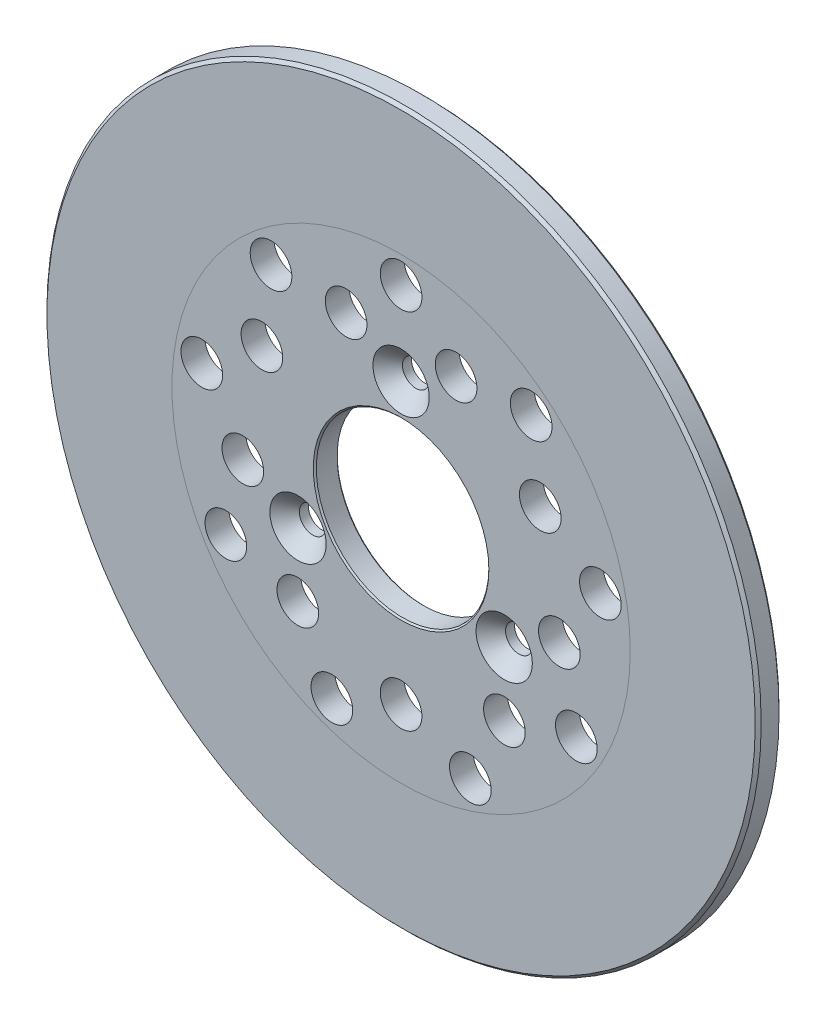
ISO-10303-21;
HEADER;
FILE_DESCRIPTION(('STEP AP214'),'2;1');
FILE_NAME('part.step','',(''),(''),'','','');
FILE_SCHEMA(('AUTOMOTIVE_DESIGN { 1 0 10303 214 1 1 1 1 }'));
ENDSEC;
DATA;
#1=APPLICATION_CONTEXT('core data for automotive mechanical design processes');
#2=APPLICATION_PROTOCOL_DEFINITION('international standard','automotive_design',2000,#1);
#3=PRODUCT_CONTEXT('',#1,'mechanical');
#4=PRODUCT('Part','Part','',(#3));
#5=PRODUCT_RELATED_PRODUCT_CATEGORY('part','',(#4));
#6=PRODUCT_DEFINITION_FORMATION('','',#4);
#7=PRODUCT_DEFINITION_CONTEXT('part definition',#1,'design');
#8=PRODUCT_DEFINITION('design','',#6,#7);
#9=PRODUCT_DEFINITION_SHAPE('','',#8);
#10=(LENGTH_UNIT() NAMED_UNIT(*) SI_UNIT(.MILLI.,.METRE.));
#11=(NAMED_UNIT(*) PLANE_ANGLE_UNIT() SI_UNIT($,.RADIAN.));
#12=(NAMED_UNIT(*) SI_UNIT($,.STERADIAN.) SOLID_ANGLE_UNIT());
#13=UNCERTAINTY_MEASURE_WITH_UNIT(LENGTH_MEASURE(1.E-05),#10,'distance_accuracy_value','');
#14=(GEOMETRIC_REPRESENTATION_CONTEXT(3) GLOBAL_UNCERTAINTY_ASSIGNED_CONTEXT((#13)) GLOBAL_UNIT_ASSIGNED_CONTEXT((#10,
#11,#12)) REPRESENTATION_CONTEXT('',''));
#15=CARTESIAN_POINT('',(0.,0.,0.));
#16=DIRECTION('',(0.,0.,1.));
#17=DIRECTION('',(1.,0.,0.));
#18=AXIS2_PLACEMENT_3D('',#15,#16,#17);
#19=CARTESIAN_POINT('',(0.,0.,0.));
#20=DIRECTION('',(0.,0.,1.));
#21=DIRECTION('',(1.,0.,0.));
#22=AXIS2_PLACEMENT_3D('',#19,#20,#21);
#23=PLANE('',#22);
#24=CARTESIAN_POINT('',(0.,0.,0.));
#25=DIRECTION('',(0.,0.,1.));
#26=DIRECTION('',(1.,0.,0.));
#27=AXIS2_PLACEMENT_3D('',#24,#25,#26);
#28=CIRCLE('',#27,119.);
#29=CARTESIAN_POINT('',(119.,0.,0.));
#30=VERTEX_POINT('',#29);
#31=EDGE_CURVE('E45',#30,#30,#28,.F.);
#32=ORIENTED_EDGE('',*,*,#31,.T.);
#33=EDGE_LOOP('',(#32));
#34=FACE_BOUND('',#33,.T.);
#35=CARTESIAN_POINT('',(0.,0.,0.));
#36=DIRECTION('',(0.,0.,1.));
#37=DIRECTION('',(1.,0.,0.));
#38=AXIS2_PLACEMENT_3D('',#35,#36,#37);
#39=CIRCLE('',#38,77.);
#40=CARTESIAN_POINT('',(77.,0.,0.));
#41=VERTEX_POINT('',#40);
#42=EDGE_CURVE('E58',#41,#41,#39,.F.);
#43=ORIENTED_EDGE('',*,*,#42,.F.);
#44=EDGE_LOOP('',(#43));
#45=FACE_BOUND('',#44,.T.);
#46=ADVANCED_FACE('F38',(#34,#45),#23,.F.);
#47=CARTESIAN_POINT('',(0.,0.,8.));
#48=DIRECTION('',(0.,0.,1.));
#49=DIRECTION('',(1.,0.,0.));
#50=AXIS2_PLACEMENT_3D('',#47,#48,#49);
#51=PLANE('',#50);
#52=CARTESIAN_POINT('',(0.,0.,8.));
#53=DIRECTION('',(0.,0.,1.));
#54=DIRECTION('',(1.,0.,0.));
#55=AXIS2_PLACEMENT_3D('',#52,#53,#54);
#56=CIRCLE('',#55,119.);
#57=CARTESIAN_POINT('',(119.,0.,8.));
#58=VERTEX_POINT('',#57);
#59=EDGE_CURVE('E10',#58,#58,#56,.T.);
#60=ORIENTED_EDGE('',*,*,#59,.T.);
#61=EDGE_LOOP('',(#60));
#62=FACE_BOUND('',#61,.T.);
#63=CARTESIAN_POINT('',(0.,0.,8.));
#64=DIRECTION('',(0.,0.,1.));
#65=DIRECTION('',(1.,0.,0.));
#66=AXIS2_PLACEMENT_3D('',#63,#64,#65);
#67=CIRCLE('',#66,77.);
#68=CARTESIAN_POINT('',(77.,0.,8.));
#69=VERTEX_POINT('',#68);
#70=EDGE_CURVE('E59',#69,#69,#67,.F.);
#71=ORIENTED_EDGE('',*,*,#70,.T.);
#72=EDGE_LOOP('',(#71));
#73=FACE_BOUND('',#72,.T.);
#74=ADVANCED_FACE('F227',(#62,#73),#51,.T.);
#75=CARTESIAN_POINT('',(-43.7095574586841,52.0910221320911,8.));
#76=DIRECTION('',(0.,0.,1.));
#77=DIRECTION('',(0.766044443118986,0.64278760968653,0.));
#78=AXIS2_PLACEMENT_3D('',#75,#76,#77);
#79=CIRCLE('',#78,7.);
#80=CARTESIAN_POINT('',(-38.3472463568511,56.5905353998968,8.));
#81=VERTEX_POINT('',#80);
#82=EDGE_CURVE('E208',#81,#81,#79,.T.);
#83=ORIENTED_EDGE('',*,*,#82,.F.);
#84=EDGE_LOOP('',(#83));
#85=FACE_BOUND('',#84,.T.);
#86=CARTESIAN_POINT('',(-66.96692720483,11.808076081352,8.));
#87=DIRECTION('',(0.,0.,1.));
#88=DIRECTION('',(0.17364817766694,0.984807753012206,0.));
#89=AXIS2_PLACEMENT_3D('',#86,#87,#88);
#90=CIRCLE('',#89,7.);
#91=CARTESIAN_POINT('',(-65.7513899611614,18.7017303524374,8.));
#92=VERTEX_POINT('',#91);
#93=EDGE_CURVE('E202',#92,#92,#90,.T.);
#94=ORIENTED_EDGE('',*,*,#93,.F.);
#95=EDGE_LOOP('',(#94));
#96=FACE_BOUND('',#95,.T.);
#97=CARTESIAN_POINT('',(-58.8897274573421,-33.9999999999995,8.));
#98=DIRECTION('',(0.,0.,1.));
#99=DIRECTION('',(-0.499999999999992,0.866025403784443,0.));
#100=AXIS2_PLACEMENT_3D('',#97,#98,#99);
#101=CIRCLE('',#100,7.);
#102=CARTESIAN_POINT('',(-62.3897274573421,-27.9378221735084,8.));
#103=VERTEX_POINT('',#102);
#104=EDGE_CURVE('E196',#103,#103,#101,.T.);
#105=ORIENTED_EDGE('',*,*,#104,.F.);
#106=EDGE_LOOP('',(#105));
#107=FACE_BOUND('',#106,.T.);
#108=CARTESIAN_POINT('',(-23.257369746146,-63.8990982134416,8.));
#109=DIRECTION('',(0.,0.,1.));
#110=DIRECTION('',(-0.939692620785906,0.342020143325676,0.));
#111=AXIS2_PLACEMENT_3D('',#108,#109,#110);
#112=CIRCLE('',#111,7.);
#113=CARTESIAN_POINT('',(-29.8352180916473,-61.5049572101619,8.));
#114=VERTEX_POINT('',#113);
#115=EDGE_CURVE('E190',#114,#114,#112,.T.);
#116=ORIENTED_EDGE('',*,*,#115,.F.);
#117=EDGE_LOOP('',(#116));
#118=FACE_BOUND('',#117,.T.);
#119=CARTESIAN_POINT('',(23.2573697461451,-63.8990982134419,8.));
#120=DIRECTION('',(0.,0.,1.));
#121=DIRECTION('',(-0.939692620785911,-0.342020143325663,0.));
#122=AXIS2_PLACEMENT_3D('',#119,#120,#121);
#123=CIRCLE('',#122,7.);
#124=CARTESIAN_POINT('',(16.6795214006437,-66.2932392167216,8.));
#125=VERTEX_POINT('',#124);
#126=EDGE_CURVE('E184',#125,#125,#123,.T.);
#127=ORIENTED_EDGE('',*,*,#126,.F.);
#128=EDGE_LOOP('',(#127));
#129=FACE_BOUND('',#128,.T.);
#130=CARTESIAN_POINT('',(58.8897274573417,-34.0000000000003,8.));
#131=DIRECTION('',(0.,0.,1.));
#132=DIRECTION('',(-0.500000000000004,-0.866025403784436,0.));
#133=AXIS2_PLACEMENT_3D('',#130,#131,#132);
#134=CIRCLE('',#133,7.);
#135=CARTESIAN_POINT('',(55.3897274573417,-40.0621778264913,8.));
#136=VERTEX_POINT('',#135);
#137=EDGE_CURVE('E178',#136,#136,#134,.T.);
#138=ORIENTED_EDGE('',*,*,#137,.F.);
#139=EDGE_LOOP('',(#138));
#140=FACE_BOUND('',#139,.T.);
#141=CARTESIAN_POINT('',(66.9669272048302,11.8080760813511,8.));
#142=DIRECTION('',(0.,0.,1.));
#143=DIRECTION('',(0.173648177666927,-0.984807753012209,0.));
#144=AXIS2_PLACEMENT_3D('',#141,#142,#143);
#145=CIRCLE('',#144,7.);
#146=CARTESIAN_POINT('',(68.1824644484987,4.9144218102656,8.));
#147=VERTEX_POINT('',#146);
#148=EDGE_CURVE('E172',#147,#147,#145,.T.);
#149=ORIENTED_EDGE('',*,*,#148,.F.);
#150=EDGE_LOOP('',(#149));
#151=FACE_BOUND('',#150,.T.);
#152=CARTESIAN_POINT('',(43.7095574586848,52.0910221320905,8.));
#153=DIRECTION('',(0.,0.,1.));
#154=DIRECTION('',(0.766044443118977,-0.642787609686541,0.));
#155=AXIS2_PLACEMENT_3D('',#152,#153,#154);
#156=CIRCLE('',#155,7.);
#157=CARTESIAN_POINT('',(49.0718685605176,47.5915088642847,8.));
#158=VERTEX_POINT('',#157);
#159=EDGE_CURVE('E166',#158,#158,#156,.T.);
#160=ORIENTED_EDGE('',*,*,#159,.F.);
#161=EDGE_LOOP('',(#160));
#162=FACE_BOUND('',#161,.T.);
#163=CARTESIAN_POINT('',(0.,68.,8.));
#164=DIRECTION('',(0.,0.,1.));
#165=DIRECTION('',(1.,0.,0.));
#166=AXIS2_PLACEMENT_3D('',#163,#164,#165);
#167=CIRCLE('',#166,7.);
#168=CARTESIAN_POINT('',(7.,68.,8.));
#169=VERTEX_POINT('',#168);
#170=EDGE_CURVE('E160',#169,#169,#167,.T.);
#171=ORIENTED_EDGE('',*,*,#170,.F.);
#172=EDGE_LOOP('',(#171));
#173=FACE_BOUND('',#172,.T.);
#174=ORIENTED_EDGE('',*,*,#70,.F.);
#175=EDGE_LOOP('',(#174));
#176=FACE_BOUND('',#175,.T.);
#177=CARTESIAN_POINT('',(-18.4690877395855,50.7434015224393,8.));
#178=DIRECTION('',(0.,0.,1.));
#179=DIRECTION('',(0.766044443118986,0.64278760968653,0.));
#180=AXIS2_PLACEMENT_3D('',#177,#178,#179);
#181=CIRCLE('',#180,7.);
#182=CARTESIAN_POINT('',(-13.1067766377526,55.242914790245,8.));
#183=VERTEX_POINT('',#182);
#184=EDGE_CURVE('E154',#183,#183,#181,.T.);
#185=ORIENTED_EDGE('',*,*,#184,.F.);
#186=EDGE_LOOP('',(#185));
#187=FACE_BOUND('',#186,.T.);
#188=CARTESIAN_POINT('',(-46.7653718043594,27.0000000000005,8.));
#189=DIRECTION('',(0.,0.,1.));
#190=DIRECTION('',(0.17364817766694,0.984807753012206,0.));
#191=AXIS2_PLACEMENT_3D('',#188,#189,#190);
#192=CIRCLE('',#191,7.);
#193=CARTESIAN_POINT('',(-45.5498345606908,33.893654271086,8.));
#194=VERTEX_POINT('',#193);
#195=EDGE_CURVE('E148',#194,#194,#192,.T.);
#196=ORIENTED_EDGE('',*,*,#195,.F.);
#197=EDGE_LOOP('',(#196));
#198=FACE_BOUND('',#197,.T.);
#199=CARTESIAN_POINT('',(-53.1796186626593,-9.37700159401371,8.));
#200=DIRECTION('',(0.,0.,1.));
#201=DIRECTION('',(-0.499999999999992,0.866025403784443,0.));
#202=AXIS2_PLACEMENT_3D('',#199,#200,#201);
#203=CIRCLE('',#202,7.);
#204=CARTESIAN_POINT('',(-56.6796186626593,-3.3148237675226,8.));
#205=VERTEX_POINT('',#204);
#206=EDGE_CURVE('E142',#205,#205,#203,.T.);
#207=ORIENTED_EDGE('',*,*,#206,.F.);
#208=EDGE_LOOP('',(#207));
#209=FACE_BOUND('',#208,.T.);
#210=CARTESIAN_POINT('',(-34.7105309230735,-41.3663999284245,8.));
#211=DIRECTION('',(0.,0.,1.));
#212=DIRECTION('',(-0.939692620785906,0.342020143325676,0.));
#213=AXIS2_PLACEMENT_3D('',#210,#211,#212);
#214=CIRCLE('',#213,7.);
#215=CARTESIAN_POINT('',(-41.2883792685748,-38.9722589251448,8.));
#216=VERTEX_POINT('',#215);
#217=EDGE_CURVE('E136',#216,#216,#214,.T.);
#218=ORIENTED_EDGE('',*,*,#217,.F.);
#219=EDGE_LOOP('',(#218));
#220=FACE_BOUND('',#219,.T.);
#221=CARTESIAN_POINT('',(-3.67761376907083E-13,-54.,8.));
#222=DIRECTION('',(0.,0.,1.));
#223=DIRECTION('',(-0.939692620785911,-0.342020143325663,0.));
#224=AXIS2_PLACEMENT_3D('',#221,#222,#223);
#225=CIRCLE('',#224,7.);
#226=CARTESIAN_POINT('',(-6.57784834550174,-56.3941410032796,8.));
#227=VERTEX_POINT('',#226);
#228=EDGE_CURVE('E130',#227,#227,#225,.T.);
#229=ORIENTED_EDGE('',*,*,#228,.F.);
#230=EDGE_LOOP('',(#229));
#231=FACE_BOUND('',#230,.T.);
#232=CARTESIAN_POINT('',(34.7105309230729,-41.366399928425,8.));
#233=DIRECTION('',(0.,0.,1.));
#234=DIRECTION('',(-0.500000000000004,-0.866025403784436,0.));
#235=AXIS2_PLACEMENT_3D('',#232,#233,#234);
#236=CIRCLE('',#235,7.);
#237=CARTESIAN_POINT('',(31.2105309230729,-47.4285777549161,8.));
#238=VERTEX_POINT('',#237);
#239=EDGE_CURVE('E124',#238,#238,#236,.T.);
#240=ORIENTED_EDGE('',*,*,#239,.F.);
#241=EDGE_LOOP('',(#240));
#242=FACE_BOUND('',#241,.T.);
#243=CARTESIAN_POINT('',(53.1796186626592,-9.37700159401444,8.));
#244=DIRECTION('',(0.,0.,1.));
#245=DIRECTION('',(0.173648177666927,-0.984807753012209,0.));
#246=AXIS2_PLACEMENT_3D('',#243,#244,#245);
#247=CIRCLE('',#246,7.);
#248=CARTESIAN_POINT('',(54.3951559063277,-16.2706558650999,8.));
#249=VERTEX_POINT('',#248);
#250=EDGE_CURVE('E118',#249,#249,#247,.T.);
#251=ORIENTED_EDGE('',*,*,#250,.F.);
#252=EDGE_LOOP('',(#251));
#253=FACE_BOUND('',#252,.T.);
#254=CARTESIAN_POINT('',(46.7653718043598,26.9999999999999,8.));
#255=DIRECTION('',(0.,0.,1.));
#256=DIRECTION('',(0.766044443118977,-0.642787609686541,0.));
#257=AXIS2_PLACEMENT_3D('',#254,#255,#256);
#258=CIRCLE('',#257,7.);
#259=CARTESIAN_POINT('',(52.1276829061926,22.5004867321941,8.));
#260=VERTEX_POINT('',#259);
#261=EDGE_CURVE('E112',#260,#260,#258,.T.);
#262=ORIENTED_EDGE('',*,*,#261,.F.);
#263=EDGE_LOOP('',(#262));
#264=FACE_BOUND('',#263,.T.);
#265=CARTESIAN_POINT('',(18.4690877395861,50.743401522439,8.));
#266=DIRECTION('',(0.,0.,1.));
#267=DIRECTION('',(1.,0.,0.));
#268=AXIS2_PLACEMENT_3D('',#265,#266,#267);
#269=CIRCLE('',#268,7.);
#270=CARTESIAN_POINT('',(25.4690877395861,50.743401522439,8.));
#271=VERTEX_POINT('',#270);
#272=EDGE_CURVE('E106',#271,#271,#269,.T.);
#273=ORIENTED_EDGE('',*,*,#272,.F.);
#274=EDGE_LOOP('',(#273));
#275=FACE_BOUND('',#274,.T.);
#276=CARTESIAN_POINT('',(0.,0.,8.));
#277=DIRECTION('',(0.,0.,1.));
#278=DIRECTION('',(1.,0.,0.));
#279=AXIS2_PLACEMENT_3D('',#276,#277,#278);
#280=CIRCLE('',#279,29.5);
#281=CARTESIAN_POINT('',(29.5,0.,8.));
#282=VERTEX_POINT('',#281);
#283=EDGE_CURVE('E63',#282,#282,#280,.F.);
#284=ORIENTED_EDGE('',*,*,#283,.T.);
#285=EDGE_LOOP('',(#284));
#286=FACE_BOUND('',#285,.T.);
#287=CARTESIAN_POINT('',(0.,40.,8.));
#288=DIRECTION('',(0.,0.,1.));
#289=DIRECTION('',(1.,0.,0.));
#290=AXIS2_PLACEMENT_3D('',#287,#288,#289);
#291=CIRCLE('',#290,9.46);
#292=CARTESIAN_POINT('',(9.46,40.,8.));
#293=VERTEX_POINT('',#292);
#294=EDGE_CURVE('E102',#293,#293,#291,.T.);
#295=ORIENTED_EDGE('',*,*,#294,.F.);
#296=EDGE_LOOP('',(#295));
#297=FACE_BOUND('',#296,.T.);
#298=CARTESIAN_POINT('',(34.6410161513775,-20.0000000000002,8.));
#299=DIRECTION('',(0.,0.,1.));
#300=DIRECTION('',(1.,0.,0.));
#301=AXIS2_PLACEMENT_3D('',#298,#299,#300);
#302=CIRCLE('',#301,9.46);
#303=CARTESIAN_POINT('',(44.1010161513775,-20.0000000000002,8.));
#304=VERTEX_POINT('',#303);
#305=EDGE_CURVE('E93',#304,#304,#302,.T.);
#306=ORIENTED_EDGE('',*,*,#305,.F.);
#307=EDGE_LOOP('',(#306));
#308=FACE_BOUND('',#307,.T.);
#309=CARTESIAN_POINT('',(-34.6410161513774,-20.0000000000002,8.));
#310=DIRECTION('',(0.,0.,1.));
#311=DIRECTION('',(1.,0.,0.));
#312=AXIS2_PLACEMENT_3D('',#309,#310,#311);
#313=CIRCLE('',#312,9.46);
#314=CARTESIAN_POINT('',(-25.1810161513774,-20.0000000000002,8.));
#315=VERTEX_POINT('',#314);
#316=EDGE_CURVE('E84',#315,#315,#313,.T.);
#317=ORIENTED_EDGE('',*,*,#316,.F.);
#318=EDGE_LOOP('',(#317));
#319=FACE_BOUND('',#318,.T.);
#320=ADVANCED_FACE('F224',(#85,#96,#107,#118,#129,#140,#151,#162,#173,#176,#187,#198,#209,#220,
#231,#242,#253,#264,#275,#286,#297,#308,#319),#51,.T.);
#321=CARTESIAN_POINT('',(-43.7095574586841,52.0910221320911,0.));
#322=DIRECTION('',(0.,0.,1.));
#323=DIRECTION('',(0.766044443118986,0.64278760968653,0.));
#324=AXIS2_PLACEMENT_3D('',#321,#322,#323);
#325=CIRCLE('',#324,7.);
#326=CARTESIAN_POINT('',(-38.3472463568511,56.5905353998968,0.));
#327=VERTEX_POINT('',#326);
#328=EDGE_CURVE('E205',#327,#327,#325,.T.);
#329=ORIENTED_EDGE('',*,*,#328,.T.);
#330=EDGE_LOOP('',(#329));
#331=FACE_BOUND('',#330,.T.);
#332=CARTESIAN_POINT('',(-66.96692720483,11.808076081352,0.));
#333=DIRECTION('',(0.,0.,1.));
#334=DIRECTION('',(0.17364817766694,0.984807753012206,0.));
#335=AXIS2_PLACEMENT_3D('',#332,#333,#334);
#336=CIRCLE('',#335,7.);
#337=CARTESIAN_POINT('',(-65.7513899611614,18.7017303524374,0.));
#338=VERTEX_POINT('',#337);
#339=EDGE_CURVE('E199',#338,#338,#336,.T.);
#340=ORIENTED_EDGE('',*,*,#339,.T.);
#341=EDGE_LOOP('',(#340));
#342=FACE_BOUND('',#341,.T.);
#343=CARTESIAN_POINT('',(-58.8897274573421,-33.9999999999995,0.));
#344=DIRECTION('',(0.,0.,1.));
#345=DIRECTION('',(-0.499999999999992,0.866025403784443,0.));
#346=AXIS2_PLACEMENT_3D('',#343,#344,#345);
#347=CIRCLE('',#346,7.);
#348=CARTESIAN_POINT('',(-62.3897274573421,-27.9378221735084,0.));
#349=VERTEX_POINT('',#348);
#350=EDGE_CURVE('E193',#349,#349,#347,.T.);
#351=ORIENTED_EDGE('',*,*,#350,.T.);
#352=EDGE_LOOP('',(#351));
#353=FACE_BOUND('',#352,.T.);
#354=CARTESIAN_POINT('',(-23.257369746146,-63.8990982134416,0.));
#355=DIRECTION('',(0.,0.,1.));
#356=DIRECTION('',(-0.939692620785906,0.342020143325676,0.));
#357=AXIS2_PLACEMENT_3D('',#354,#355,#356);
#358=CIRCLE('',#357,7.);
#359=CARTESIAN_POINT('',(-29.8352180916473,-61.5049572101619,0.));
#360=VERTEX_POINT('',#359);
#361=EDGE_CURVE('E187',#360,#360,#358,.T.);
#362=ORIENTED_EDGE('',*,*,#361,.T.);
#363=EDGE_LOOP('',(#362));
#364=FACE_BOUND('',#363,.T.);
#365=CARTESIAN_POINT('',(23.2573697461451,-63.8990982134419,0.));
#366=DIRECTION('',(0.,0.,1.));
#367=DIRECTION('',(-0.939692620785911,-0.342020143325663,0.));
#368=AXIS2_PLACEMENT_3D('',#365,#366,#367);
#369=CIRCLE('',#368,7.);
#370=CARTESIAN_POINT('',(16.6795214006437,-66.2932392167216,0.));
#371=VERTEX_POINT('',#370);
#372=EDGE_CURVE('E181',#371,#371,#369,.T.);
#373=ORIENTED_EDGE('',*,*,#372,.T.);
#374=EDGE_LOOP('',(#373));
#375=FACE_BOUND('',#374,.T.);
#376=CARTESIAN_POINT('',(58.8897274573417,-34.0000000000003,0.));
#377=DIRECTION('',(0.,0.,1.));
#378=DIRECTION('',(-0.500000000000004,-0.866025403784436,0.));
#379=AXIS2_PLACEMENT_3D('',#376,#377,#378);
#380=CIRCLE('',#379,7.);
#381=CARTESIAN_POINT('',(55.3897274573417,-40.0621778264913,0.));
#382=VERTEX_POINT('',#381);
#383=EDGE_CURVE('E175',#382,#382,#380,.T.);
#384=ORIENTED_EDGE('',*,*,#383,.T.);
#385=EDGE_LOOP('',(#384));
#386=FACE_BOUND('',#385,.T.);
#387=CARTESIAN_POINT('',(66.9669272048302,11.8080760813511,0.));
#388=DIRECTION('',(0.,0.,1.));
#389=DIRECTION('',(0.173648177666927,-0.984807753012209,0.));
#390=AXIS2_PLACEMENT_3D('',#387,#388,#389);
#391=CIRCLE('',#390,7.);
#392=CARTESIAN_POINT('',(68.1824644484987,4.9144218102656,0.));
#393=VERTEX_POINT('',#392);
#394=EDGE_CURVE('E169',#393,#393,#391,.T.);
#395=ORIENTED_EDGE('',*,*,#394,.T.);
#396=EDGE_LOOP('',(#395));
#397=FACE_BOUND('',#396,.T.);
#398=CARTESIAN_POINT('',(43.7095574586848,52.0910221320905,0.));
#399=DIRECTION('',(0.,0.,1.));
#400=DIRECTION('',(0.766044443118977,-0.642787609686541,0.));
#401=AXIS2_PLACEMENT_3D('',#398,#399,#400);
#402=CIRCLE('',#401,7.);
#403=CARTESIAN_POINT('',(49.0718685605176,47.5915088642847,0.));
#404=VERTEX_POINT('',#403);
#405=EDGE_CURVE('E163',#404,#404,#402,.T.);
#406=ORIENTED_EDGE('',*,*,#405,.T.);
#407=EDGE_LOOP('',(#406));
#408=FACE_BOUND('',#407,.T.);
#409=CARTESIAN_POINT('',(0.,68.,0.));
#410=DIRECTION('',(0.,0.,1.));
#411=DIRECTION('',(1.,0.,0.));
#412=AXIS2_PLACEMENT_3D('',#409,#410,#411);
#413=CIRCLE('',#412,7.);
#414=CARTESIAN_POINT('',(7.,68.,0.));
#415=VERTEX_POINT('',#414);
#416=EDGE_CURVE('E157',#415,#415,#413,.T.);
#417=ORIENTED_EDGE('',*,*,#416,.T.);
#418=EDGE_LOOP('',(#417));
#419=FACE_BOUND('',#418,.T.);
#420=ORIENTED_EDGE('',*,*,#42,.T.);
#421=EDGE_LOOP('',(#420));
#422=FACE_BOUND('',#421,.T.);
#423=CARTESIAN_POINT('',(-18.4690877395855,50.7434015224393,0.));
#424=DIRECTION('',(0.,0.,1.));
#425=DIRECTION('',(0.766044443118986,0.64278760968653,0.));
#426=AXIS2_PLACEMENT_3D('',#423,#424,#425);
#427=CIRCLE('',#426,7.);
#428=CARTESIAN_POINT('',(-13.1067766377526,55.242914790245,0.));
#429=VERTEX_POINT('',#428);
#430=EDGE_CURVE('E151',#429,#429,#427,.T.);
#431=ORIENTED_EDGE('',*,*,#430,.T.);
#432=EDGE_LOOP('',(#431));
#433=FACE_BOUND('',#432,.T.);
#434=CARTESIAN_POINT('',(-46.7653718043594,27.0000000000005,0.));
#435=DIRECTION('',(0.,0.,1.));
#436=DIRECTION('',(0.17364817766694,0.984807753012206,0.));
#437=AXIS2_PLACEMENT_3D('',#434,#435,#436);
#438=CIRCLE('',#437,7.);
#439=CARTESIAN_POINT('',(-45.5498345606908,33.893654271086,0.));
#440=VERTEX_POINT('',#439);
#441=EDGE_CURVE('E145',#440,#440,#438,.T.);
#442=ORIENTED_EDGE('',*,*,#441,.T.);
#443=EDGE_LOOP('',(#442));
#444=FACE_BOUND('',#443,.T.);
#445=CARTESIAN_POINT('',(-53.1796186626593,-9.37700159401371,0.));
#446=DIRECTION('',(0.,0.,1.));
#447=DIRECTION('',(-0.499999999999992,0.866025403784443,0.));
#448=AXIS2_PLACEMENT_3D('',#445,#446,#447);
#449=CIRCLE('',#448,7.);
#450=CARTESIAN_POINT('',(-56.6796186626593,-3.3148237675226,0.));
#451=VERTEX_POINT('',#450);
#452=EDGE_CURVE('E139',#451,#451,#449,.T.);
#453=ORIENTED_EDGE('',*,*,#452,.T.);
#454=EDGE_LOOP('',(#453));
#455=FACE_BOUND('',#454,.T.);
#456=CARTESIAN_POINT('',(-34.7105309230735,-41.3663999284245,0.));
#457=DIRECTION('',(0.,0.,1.));
#458=DIRECTION('',(-0.939692620785906,0.342020143325676,0.));
#459=AXIS2_PLACEMENT_3D('',#456,#457,#458);
#460=CIRCLE('',#459,7.);
#461=CARTESIAN_POINT('',(-41.2883792685748,-38.9722589251448,0.));
#462=VERTEX_POINT('',#461);
#463=EDGE_CURVE('E133',#462,#462,#460,.T.);
#464=ORIENTED_EDGE('',*,*,#463,.T.);
#465=EDGE_LOOP('',(#464));
#466=FACE_BOUND('',#465,.T.);
#467=CARTESIAN_POINT('',(-3.67761376907083E-13,-54.,0.));
#468=DIRECTION('',(0.,0.,1.));
#469=DIRECTION('',(-0.939692620785911,-0.342020143325663,0.));
#470=AXIS2_PLACEMENT_3D('',#467,#468,#469);
#471=CIRCLE('',#470,7.);
#472=CARTESIAN_POINT('',(-6.57784834550174,-56.3941410032796,0.));
#473=VERTEX_POINT('',#472);
#474=EDGE_CURVE('E127',#473,#473,#471,.T.);
#475=ORIENTED_EDGE('',*,*,#474,.T.);
#476=EDGE_LOOP('',(#475));
#477=FACE_BOUND('',#476,.T.);
#478=CARTESIAN_POINT('',(34.7105309230729,-41.366399928425,0.));
#479=DIRECTION('',(0.,0.,1.));
#480=DIRECTION('',(-0.500000000000004,-0.866025403784436,0.));
#481=AXIS2_PLACEMENT_3D('',#478,#479,#480);
#482=CIRCLE('',#481,7.);
#483=CARTESIAN_POINT('',(31.2105309230729,-47.4285777549161,0.));
#484=VERTEX_POINT('',#483);
#485=EDGE_CURVE('E121',#484,#484,#482,.T.);
#486=ORIENTED_EDGE('',*,*,#485,.T.);
#487=EDGE_LOOP('',(#486));
#488=FACE_BOUND('',#487,.T.);
#489=CARTESIAN_POINT('',(53.1796186626592,-9.37700159401444,0.));
#490=DIRECTION('',(0.,0.,1.));
#491=DIRECTION('',(0.173648177666927,-0.984807753012209,0.));
#492=AXIS2_PLACEMENT_3D('',#489,#490,#491);
#493=CIRCLE('',#492,7.);
#494=CARTESIAN_POINT('',(54.3951559063277,-16.2706558650999,0.));
#495=VERTEX_POINT('',#494);
#496=EDGE_CURVE('E115',#495,#495,#493,.T.);
#497=ORIENTED_EDGE('',*,*,#496,.T.);
#498=EDGE_LOOP('',(#497));
#499=FACE_BOUND('',#498,.T.);
#500=CARTESIAN_POINT('',(46.7653718043598,26.9999999999999,0.));
#501=DIRECTION('',(0.,0.,1.));
#502=DIRECTION('',(0.766044443118977,-0.642787609686541,0.));
#503=AXIS2_PLACEMENT_3D('',#500,#501,#502);
#504=CIRCLE('',#503,7.);
#505=CARTESIAN_POINT('',(52.1276829061926,22.5004867321941,0.));
#506=VERTEX_POINT('',#505);
#507=EDGE_CURVE('E109',#506,#506,#504,.T.);
#508=ORIENTED_EDGE('',*,*,#507,.T.);
#509=EDGE_LOOP('',(#508));
#510=FACE_BOUND('',#509,.T.);
#511=CARTESIAN_POINT('',(18.4690877395861,50.743401522439,0.));
#512=DIRECTION('',(0.,0.,1.));
#513=DIRECTION('',(1.,0.,0.));
#514=AXIS2_PLACEMENT_3D('',#511,#512,#513);
#515=CIRCLE('',#514,7.);
#516=CARTESIAN_POINT('',(25.4690877395861,50.743401522439,0.));
#517=VERTEX_POINT('',#516);
#518=EDGE_CURVE('E105',#517,#517,#515,.T.);
#519=ORIENTED_EDGE('',*,*,#518,.T.);
#520=EDGE_LOOP('',(#519));
#521=FACE_BOUND('',#520,.T.);
#522=CARTESIAN_POINT('',(0.,0.,0.));
#523=DIRECTION('',(0.,0.,1.));
#524=DIRECTION('',(1.,0.,0.));
#525=AXIS2_PLACEMENT_3D('',#522,#523,#524);
#526=CIRCLE('',#525,29.4999999999999);
#527=CARTESIAN_POINT('',(29.4999999999999,0.,0.));
#528=VERTEX_POINT('',#527);
#529=EDGE_CURVE('E75',#528,#528,#526,.T.);
#530=ORIENTED_EDGE('',*,*,#529,.T.);
#531=EDGE_LOOP('',(#530));
#532=FACE_BOUND('',#531,.T.);
#533=CARTESIAN_POINT('',(0.,40.,0.));
#534=DIRECTION('',(0.,0.,1.));
#535=DIRECTION('',(1.,0.,0.));
#536=AXIS2_PLACEMENT_3D('',#533,#534,#535);
#537=CIRCLE('',#536,4.5);
#538=CARTESIAN_POINT('',(4.5,40.,0.));
#539=VERTEX_POINT('',#538);
#540=EDGE_CURVE('E96',#539,#539,#537,.T.);
#541=ORIENTED_EDGE('',*,*,#540,.T.);
#542=EDGE_LOOP('',(#541));
#543=FACE_BOUND('',#542,.T.);
#544=CARTESIAN_POINT('',(34.6410161513775,-20.0000000000002,0.));
#545=DIRECTION('',(0.,0.,1.));
#546=DIRECTION('',(1.,0.,0.));
#547=AXIS2_PLACEMENT_3D('',#544,#545,#546);
#548=CIRCLE('',#547,4.5);
#549=CARTESIAN_POINT('',(39.1410161513774,-20.0000000000002,0.));
#550=VERTEX_POINT('',#549);
#551=EDGE_CURVE('E87',#550,#550,#548,.T.);
#552=ORIENTED_EDGE('',*,*,#551,.T.);
#553=EDGE_LOOP('',(#552));
#554=FACE_BOUND('',#553,.T.);
#555=CARTESIAN_POINT('',(-34.6410161513774,-20.0000000000002,0.));
#556=DIRECTION('',(0.,0.,1.));
#557=DIRECTION('',(1.,0.,0.));
#558=AXIS2_PLACEMENT_3D('',#555,#556,#557);
#559=CIRCLE('',#558,4.5);
#560=CARTESIAN_POINT('',(-30.1410161513775,-20.0000000000002,0.));
#561=VERTEX_POINT('',#560);
#562=EDGE_CURVE('E78',#561,#561,#559,.T.);
#563=ORIENTED_EDGE('',*,*,#562,.T.);
#564=EDGE_LOOP('',(#563));
#565=FACE_BOUND('',#564,.T.);
#566=ADVANCED_FACE('F214',(#331,#342,#353,#364,#375,#386,#397,#408,#419,#422,#433,#444,#455,
#466,#477,#488,#499,#510,#521,#532,#543,#554,#565),#23,.F.);
#567=CARTESIAN_POINT('',(0.,0.,8.));
#568=DIRECTION('',(0.,0.,-1.));
#569=DIRECTION('',(-1.,0.,0.));
#570=AXIS2_PLACEMENT_3D('',#567,#568,#569);
#571=CYLINDRICAL_SURFACE('',#570,120.);
#572=CARTESIAN_POINT('',(0.,0.,0.999999999999959));
#573=DIRECTION('',(0.,0.,1.));
#574=DIRECTION('',(1.,0.,0.));
#575=AXIS2_PLACEMENT_3D('',#572,#573,#574);
#576=CIRCLE('',#575,120.);
#577=CARTESIAN_POINT('',(120.,0.,0.999999999999959));
#578=VERTEX_POINT('',#577);
#579=EDGE_CURVE('E49',#578,#578,#576,.T.);
#580=ORIENTED_EDGE('',*,*,#579,.T.);
#581=EDGE_LOOP('',(#580));
#582=FACE_BOUND('',#581,.T.);
#583=CARTESIAN_POINT('',(0.,0.,6.99999999999999));
#584=DIRECTION('',(0.,0.,1.));
#585=DIRECTION('',(1.,0.,0.));
#586=AXIS2_PLACEMENT_3D('',#583,#584,#585);
#587=CIRCLE('',#586,120.);
#588=CARTESIAN_POINT('',(120.,0.,6.99999999999999));
#589=VERTEX_POINT('',#588);
#590=EDGE_CURVE('E53',#589,#589,#587,.F.);
#591=ORIENTED_EDGE('',*,*,#590,.T.);
#592=EDGE_LOOP('',(#591));
#593=FACE_BOUND('',#592,.T.);
#594=ADVANCED_FACE('F298',(#582,#593),#571,.T.);
#595=CARTESIAN_POINT('',(0.,0.,8.));
#596=DIRECTION('',(0.,0.,-1.));
#597=DIRECTION('',(-1.,0.,0.));
#598=AXIS2_PLACEMENT_3D('',#595,#596,#597);
#599=CYLINDRICAL_SURFACE('',#598,29.);
#600=CARTESIAN_POINT('',(0.,0.,7.49999999999998));
#601=DIRECTION('',(0.,0.,1.));
#602=DIRECTION('',(1.,0.,0.));
#603=AXIS2_PLACEMENT_3D('',#600,#601,#602);
#604=CIRCLE('',#603,29.);
#605=CARTESIAN_POINT('',(29.,0.,7.49999999999998));
#606=VERTEX_POINT('',#605);
#607=EDGE_CURVE('E69',#606,#606,#604,.T.);
#608=ORIENTED_EDGE('',*,*,#607,.T.);
#609=EDGE_LOOP('',(#608));
#610=FACE_BOUND('',#609,.T.);
#611=CARTESIAN_POINT('',(0.,0.,0.499999999999945));
#612=DIRECTION('',(0.,0.,1.));
#613=DIRECTION('',(1.,0.,0.));
#614=AXIS2_PLACEMENT_3D('',#611,#612,#613);
#615=CIRCLE('',#614,29.);
#616=CARTESIAN_POINT('',(29.,0.,0.499999999999945));
#617=VERTEX_POINT('',#616);
#618=EDGE_CURVE('E72',#617,#617,#615,.F.);
#619=ORIENTED_EDGE('',*,*,#618,.T.);
#620=EDGE_LOOP('',(#619));
#621=FACE_BOUND('',#620,.T.);
#622=ADVANCED_FACE('F286',(#610,#621),#599,.F.);
#623=CARTESIAN_POINT('',(-34.6410161513774,-20.0000000000002,8.));
#624=DIRECTION('',(0.,0.,1.));
#625=DIRECTION('',(1.,0.,0.));
#626=AXIS2_PLACEMENT_3D('',#623,#624,#625);
#627=CYLINDRICAL_SURFACE('',#626,4.5);
#628=ORIENTED_EDGE('',*,*,#562,.F.);
#629=EDGE_LOOP('',(#628));
#630=FACE_BOUND('',#629,.T.);
#631=CARTESIAN_POINT('',(-34.6410161513774,-20.0000000000002,3.04));
#632=DIRECTION('',(0.,0.,1.));
#633=DIRECTION('',(1.,0.,0.));
#634=AXIS2_PLACEMENT_3D('',#631,#632,#633);
#635=CIRCLE('',#634,4.5);
#636=CARTESIAN_POINT('',(-30.1410161513775,-20.0000000000002,3.04));
#637=VERTEX_POINT('',#636);
#638=EDGE_CURVE('E81',#637,#637,#635,.T.);
#639=ORIENTED_EDGE('',*,*,#638,.T.);
#640=EDGE_LOOP('',(#639));
#641=FACE_BOUND('',#640,.T.);
#642=ADVANCED_FACE('F276',(#630,#641),#627,.F.);
#643=CARTESIAN_POINT('',(-34.6410161513774,-20.0000000000002,8.));
#644=DIRECTION('',(0.,0.,1.));
#645=DIRECTION('',(1.,0.,0.));
#646=AXIS2_PLACEMENT_3D('',#643,#644,#645);
#647=CONICAL_SURFACE('',#646,9.46,0.785398163397449);
#648=ORIENTED_EDGE('',*,*,#638,.F.);
#649=EDGE_LOOP('',(#648));
#650=FACE_BOUND('',#649,.T.);
#651=ORIENTED_EDGE('',*,*,#316,.T.);
#652=EDGE_LOOP('',(#651));
#653=FACE_BOUND('',#652,.T.);
#654=ADVANCED_FACE('F273',(#650,#653),#647,.F.);
#655=CARTESIAN_POINT('',(34.6410161513775,-20.0000000000002,8.));
#656=DIRECTION('',(0.,0.,1.));
#657=DIRECTION('',(1.,0.,0.));
#658=AXIS2_PLACEMENT_3D('',#655,#656,#657);
#659=CYLINDRICAL_SURFACE('',#658,4.5);
#660=ORIENTED_EDGE('',*,*,#551,.F.);
#661=EDGE_LOOP('',(#660));
#662=FACE_BOUND('',#661,.T.);
#663=CARTESIAN_POINT('',(34.6410161513775,-20.0000000000002,3.04));
#664=DIRECTION('',(0.,0.,1.));
#665=DIRECTION('',(1.,0.,0.));
#666=AXIS2_PLACEMENT_3D('',#663,#664,#665);
#667=CIRCLE('',#666,4.5);
#668=CARTESIAN_POINT('',(39.1410161513774,-20.0000000000002,3.04));
#669=VERTEX_POINT('',#668);
#670=EDGE_CURVE('E90',#669,#669,#667,.T.);
#671=ORIENTED_EDGE('',*,*,#670,.T.);
#672=EDGE_LOOP('',(#671));
#673=FACE_BOUND('',#672,.T.);
#674=ADVANCED_FACE('F275',(#662,#673),#659,.F.);
#675=CARTESIAN_POINT('',(34.6410161513775,-20.0000000000002,8.));
#676=DIRECTION('',(0.,0.,1.));
#677=DIRECTION('',(1.,0.,0.));
#678=AXIS2_PLACEMENT_3D('',#675,#676,#677);
#679=CONICAL_SURFACE('',#678,9.46,0.785398163397449);
#680=ORIENTED_EDGE('',*,*,#670,.F.);
#681=EDGE_LOOP('',(#680));
#682=FACE_BOUND('',#681,.T.);
#683=ORIENTED_EDGE('',*,*,#305,.T.);
#684=EDGE_LOOP('',(#683));
#685=FACE_BOUND('',#684,.T.);
#686=ADVANCED_FACE('F283',(#682,#685),#679,.F.);
#687=CARTESIAN_POINT('',(0.,40.,8.));
#688=DIRECTION('',(0.,0.,1.));
#689=DIRECTION('',(1.,0.,0.));
#690=AXIS2_PLACEMENT_3D('',#687,#688,#689);
#691=CYLINDRICAL_SURFACE('',#690,4.5);
#692=ORIENTED_EDGE('',*,*,#540,.F.);
#693=EDGE_LOOP('',(#692));
#694=FACE_BOUND('',#693,.T.);
#695=CARTESIAN_POINT('',(0.,40.,3.04));
#696=DIRECTION('',(0.,0.,1.));
#697=DIRECTION('',(1.,0.,0.));
#698=AXIS2_PLACEMENT_3D('',#695,#696,#697);
#699=CIRCLE('',#698,4.5);
#700=CARTESIAN_POINT('',(4.5,40.,3.04));
#701=VERTEX_POINT('',#700);
#702=EDGE_CURVE('E99',#701,#701,#699,.T.);
#703=ORIENTED_EDGE('',*,*,#702,.T.);
#704=EDGE_LOOP('',(#703));
#705=FACE_BOUND('',#704,.T.);
#706=ADVANCED_FACE('F375',(#694,#705),#691,.F.);
#707=CARTESIAN_POINT('',(0.,40.,8.));
#708=DIRECTION('',(0.,0.,1.));
#709=DIRECTION('',(1.,0.,0.));
#710=AXIS2_PLACEMENT_3D('',#707,#708,#709);
#711=CONICAL_SURFACE('',#710,9.46,0.785398163397449);
#712=ORIENTED_EDGE('',*,*,#702,.F.);
#713=EDGE_LOOP('',(#712));
#714=FACE_BOUND('',#713,.T.);
#715=ORIENTED_EDGE('',*,*,#294,.T.);
#716=EDGE_LOOP('',(#715));
#717=FACE_BOUND('',#716,.T.);
#718=ADVANCED_FACE('F317',(#714,#717),#711,.F.);
#719=CARTESIAN_POINT('',(0.,0.,0.));
#720=DIRECTION('',(0.,0.,-1.));
#721=DIRECTION('',(-1.,0.,0.));
#722=AXIS2_PLACEMENT_3D('',#719,#720,#721);
#723=CONICAL_SURFACE('',#722,29.4999999999999,0.785398163397448);
#724=ORIENTED_EDGE('',*,*,#618,.F.);
#725=EDGE_LOOP('',(#724));
#726=FACE_BOUND('',#725,.T.);
#727=ORIENTED_EDGE('',*,*,#529,.F.);
#728=EDGE_LOOP('',(#727));
#729=FACE_BOUND('',#728,.T.);
#730=ADVANCED_FACE('F313',(#726,#729),#723,.F.);
#731=CARTESIAN_POINT('',(0.,0.,7.49999999999998));
#732=DIRECTION('',(0.,0.,1.));
#733=DIRECTION('',(1.,0.,0.));
#734=AXIS2_PLACEMENT_3D('',#731,#732,#733);
#735=CONICAL_SURFACE('',#734,29.,0.785398163397424);
#736=ORIENTED_EDGE('',*,*,#283,.F.);
#737=EDGE_LOOP('',(#736));
#738=FACE_BOUND('',#737,.T.);
#739=ORIENTED_EDGE('',*,*,#607,.F.);
#740=EDGE_LOOP('',(#739));
#741=FACE_BOUND('',#740,.T.);
#742=ADVANCED_FACE('F316',(#738,#741),#735,.F.);
#743=CARTESIAN_POINT('',(18.4690877395861,50.743401522439,0.));
#744=DIRECTION('',(0.,0.,1.));
#745=DIRECTION('',(1.,0.,0.));
#746=AXIS2_PLACEMENT_3D('',#743,#744,#745);
#747=CYLINDRICAL_SURFACE('',#746,7.);
#748=ORIENTED_EDGE('',*,*,#518,.F.);
#749=EDGE_LOOP('',(#748));
#750=FACE_BOUND('',#749,.T.);
#751=ORIENTED_EDGE('',*,*,#272,.T.);
#752=EDGE_LOOP('',(#751));
#753=FACE_BOUND('',#752,.T.);
#754=ADVANCED_FACE('F320',(#750,#753),#747,.F.);
#755=CARTESIAN_POINT('',(46.7653718043598,26.9999999999999,0.));
#756=DIRECTION('',(0.,0.,1.));
#757=DIRECTION('',(1.,0.,0.));
#758=AXIS2_PLACEMENT_3D('',#755,#756,#757);
#759=CYLINDRICAL_SURFACE('',#758,7.);
#760=ORIENTED_EDGE('',*,*,#507,.F.);
#761=EDGE_LOOP('',(#760));
#762=FACE_BOUND('',#761,.T.);
#763=ORIENTED_EDGE('',*,*,#261,.T.);
#764=EDGE_LOOP('',(#763));
#765=FACE_BOUND('',#764,.T.);
#766=ADVANCED_FACE('F365',(#762,#765),#759,.F.);
#767=CARTESIAN_POINT('',(53.1796186626592,-9.37700159401444,0.));
#768=DIRECTION('',(0.,0.,1.));
#769=DIRECTION('',(1.,0.,0.));
#770=AXIS2_PLACEMENT_3D('',#767,#768,#769);
#771=CYLINDRICAL_SURFACE('',#770,7.);
#772=ORIENTED_EDGE('',*,*,#496,.F.);
#773=EDGE_LOOP('',(#772));
#774=FACE_BOUND('',#773,.T.);
#775=ORIENTED_EDGE('',*,*,#250,.T.);
#776=EDGE_LOOP('',(#775));
#777=FACE_BOUND('',#776,.T.);
#778=ADVANCED_FACE('F361',(#774,#777),#771,.F.);
#779=CARTESIAN_POINT('',(34.7105309230729,-41.366399928425,0.));
#780=DIRECTION('',(0.,0.,1.));
#781=DIRECTION('',(1.,0.,0.));
#782=AXIS2_PLACEMENT_3D('',#779,#780,#781);
#783=CYLINDRICAL_SURFACE('',#782,7.);
#784=ORIENTED_EDGE('',*,*,#485,.F.);
#785=EDGE_LOOP('',(#784));
#786=FACE_BOUND('',#785,.T.);
#787=ORIENTED_EDGE('',*,*,#239,.T.);
#788=EDGE_LOOP('',(#787));
#789=FACE_BOUND('',#788,.T.);
#790=ADVANCED_FACE('F357',(#786,#789),#783,.F.);
#791=CARTESIAN_POINT('',(-3.67761376907083E-13,-54.,0.));
#792=DIRECTION('',(0.,0.,1.));
#793=DIRECTION('',(1.,0.,0.));
#794=AXIS2_PLACEMENT_3D('',#791,#792,#793);
#795=CYLINDRICAL_SURFACE('',#794,7.);
#796=ORIENTED_EDGE('',*,*,#474,.F.);
#797=EDGE_LOOP('',(#796));
#798=FACE_BOUND('',#797,.T.);
#799=ORIENTED_EDGE('',*,*,#228,.T.);
#800=EDGE_LOOP('',(#799));
#801=FACE_BOUND('',#800,.T.);
#802=ADVANCED_FACE('F353',(#798,#801),#795,.F.);
#803=CARTESIAN_POINT('',(-34.7105309230735,-41.3663999284245,0.));
#804=DIRECTION('',(0.,0.,1.));
#805=DIRECTION('',(1.,0.,0.));
#806=AXIS2_PLACEMENT_3D('',#803,#804,#805);
#807=CYLINDRICAL_SURFACE('',#806,7.);
#808=ORIENTED_EDGE('',*,*,#463,.F.);
#809=EDGE_LOOP('',(#808));
#810=FACE_BOUND('',#809,.T.);
#811=ORIENTED_EDGE('',*,*,#217,.T.);
#812=EDGE_LOOP('',(#811));
#813=FACE_BOUND('',#812,.T.);
#814=ADVANCED_FACE('F349',(#810,#813),#807,.F.);
#815=CARTESIAN_POINT('',(-53.1796186626593,-9.37700159401371,0.));
#816=DIRECTION('',(0.,0.,1.));
#817=DIRECTION('',(1.,0.,0.));
#818=AXIS2_PLACEMENT_3D('',#815,#816,#817);
#819=CYLINDRICAL_SURFACE('',#818,7.);
#820=ORIENTED_EDGE('',*,*,#452,.F.);
#821=EDGE_LOOP('',(#820));
#822=FACE_BOUND('',#821,.T.);
#823=ORIENTED_EDGE('',*,*,#206,.T.);
#824=EDGE_LOOP('',(#823));
#825=FACE_BOUND('',#824,.T.);
#826=ADVANCED_FACE('F339',(#822,#825),#819,.F.);
#827=CARTESIAN_POINT('',(-46.7653718043594,27.0000000000005,0.));
#828=DIRECTION('',(0.,0.,1.));
#829=DIRECTION('',(1.,0.,0.));
#830=AXIS2_PLACEMENT_3D('',#827,#828,#829);
#831=CYLINDRICAL_SURFACE('',#830,7.);
#832=ORIENTED_EDGE('',*,*,#441,.F.);
#833=EDGE_LOOP('',(#832));
#834=FACE_BOUND('',#833,.T.);
#835=ORIENTED_EDGE('',*,*,#195,.T.);
#836=EDGE_LOOP('',(#835));
#837=FACE_BOUND('',#836,.T.);
#838=ADVANCED_FACE('F331',(#834,#837),#831,.F.);
#839=CARTESIAN_POINT('',(-18.4690877395855,50.7434015224393,0.));
#840=DIRECTION('',(0.,0.,1.));
#841=DIRECTION('',(1.,0.,0.));
#842=AXIS2_PLACEMENT_3D('',#839,#840,#841);
#843=CYLINDRICAL_SURFACE('',#842,7.);
#844=ORIENTED_EDGE('',*,*,#430,.F.);
#845=EDGE_LOOP('',(#844));
#846=FACE_BOUND('',#845,.T.);
#847=ORIENTED_EDGE('',*,*,#184,.T.);
#848=EDGE_LOOP('',(#847));
#849=FACE_BOUND('',#848,.T.);
#850=ADVANCED_FACE('F324',(#846,#849),#843,.F.);
#851=CARTESIAN_POINT('',(0.,0.,0.999999999999959));
#852=DIRECTION('',(0.,0.,1.));
#853=DIRECTION('',(1.,0.,0.));
#854=AXIS2_PLACEMENT_3D('',#851,#852,#853);
#855=CONICAL_SURFACE('',#854,120.,0.785398163397448);
#856=ORIENTED_EDGE('',*,*,#31,.F.);
#857=EDGE_LOOP('',(#856));
#858=FACE_BOUND('',#857,.T.);
#859=ORIENTED_EDGE('',*,*,#579,.F.);
#860=EDGE_LOOP('',(#859));
#861=FACE_BOUND('',#860,.T.);
#862=ADVANCED_FACE('F322',(#858,#861),#855,.T.);
#863=CARTESIAN_POINT('',(0.,0.,8.));
#864=DIRECTION('',(0.,0.,-1.));
#865=DIRECTION('',(-1.,0.,0.));
#866=AXIS2_PLACEMENT_3D('',#863,#864,#865);
#867=CONICAL_SURFACE('',#866,119.,0.785398163397462);
#868=ORIENTED_EDGE('',*,*,#590,.F.);
#869=EDGE_LOOP('',(#868));
#870=FACE_BOUND('',#869,.T.);
#871=ORIENTED_EDGE('',*,*,#59,.F.);
#872=EDGE_LOOP('',(#871));
#873=FACE_BOUND('',#872,.T.);
#874=ADVANCED_FACE('F40',(#870,#873),#867,.T.);
#875=CARTESIAN_POINT('',(0.,68.,0.));
#876=DIRECTION('',(0.,0.,1.));
#877=DIRECTION('',(1.,0.,0.));
#878=AXIS2_PLACEMENT_3D('',#875,#876,#877);
#879=CYLINDRICAL_SURFACE('',#878,7.);
#880=ORIENTED_EDGE('',*,*,#416,.F.);
#881=EDGE_LOOP('',(#880));
#882=FACE_BOUND('',#881,.T.);
#883=ORIENTED_EDGE('',*,*,#170,.T.);
#884=EDGE_LOOP('',(#883));
#885=FACE_BOUND('',#884,.T.);
#886=ADVANCED_FACE('F329',(#882,#885),#879,.F.);
#887=CARTESIAN_POINT('',(43.7095574586848,52.0910221320905,0.));
#888=DIRECTION('',(0.,0.,1.));
#889=DIRECTION('',(1.,0.,0.));
#890=AXIS2_PLACEMENT_3D('',#887,#888,#889);
#891=CYLINDRICAL_SURFACE('',#890,7.);
#892=ORIENTED_EDGE('',*,*,#405,.F.);
#893=EDGE_LOOP('',(#892));
#894=FACE_BOUND('',#893,.T.);
#895=ORIENTED_EDGE('',*,*,#159,.T.);
#896=EDGE_LOOP('',(#895));
#897=FACE_BOUND('',#896,.T.);
#898=ADVANCED_FACE('F489',(#894,#897),#891,.F.);
#899=CARTESIAN_POINT('',(66.9669272048302,11.8080760813511,0.));
#900=DIRECTION('',(0.,0.,1.));
#901=DIRECTION('',(1.,0.,0.));
#902=AXIS2_PLACEMENT_3D('',#899,#900,#901);
#903=CYLINDRICAL_SURFACE('',#902,7.);
#904=ORIENTED_EDGE('',*,*,#394,.F.);
#905=EDGE_LOOP('',(#904));
#906=FACE_BOUND('',#905,.T.);
#907=ORIENTED_EDGE('',*,*,#148,.T.);
#908=EDGE_LOOP('',(#907));
#909=FACE_BOUND('',#908,.T.);
#910=ADVANCED_FACE('F496',(#906,#909),#903,.F.);
#911=CARTESIAN_POINT('',(58.8897274573417,-34.0000000000003,0.));
#912=DIRECTION('',(0.,0.,1.));
#913=DIRECTION('',(1.,0.,0.));
#914=AXIS2_PLACEMENT_3D('',#911,#912,#913);
#915=CYLINDRICAL_SURFACE('',#914,7.);
#916=ORIENTED_EDGE('',*,*,#383,.F.);
#917=EDGE_LOOP('',(#916));
#918=FACE_BOUND('',#917,.T.);
#919=ORIENTED_EDGE('',*,*,#137,.T.);
#920=EDGE_LOOP('',(#919));
#921=FACE_BOUND('',#920,.T.);
#922=ADVANCED_FACE('F504',(#918,#921),#915,.F.);
#923=CARTESIAN_POINT('',(23.2573697461451,-63.8990982134419,0.));
#924=DIRECTION('',(0.,0.,1.));
#925=DIRECTION('',(1.,0.,0.));
#926=AXIS2_PLACEMENT_3D('',#923,#924,#925);
#927=CYLINDRICAL_SURFACE('',#926,7.);
#928=ORIENTED_EDGE('',*,*,#372,.F.);
#929=EDGE_LOOP('',(#928));
#930=FACE_BOUND('',#929,.T.);
#931=ORIENTED_EDGE('',*,*,#126,.T.);
#932=EDGE_LOOP('',(#931));
#933=FACE_BOUND('',#932,.T.);
#934=ADVANCED_FACE('F513',(#930,#933),#927,.F.);
#935=CARTESIAN_POINT('',(-23.257369746146,-63.8990982134416,0.));
#936=DIRECTION('',(0.,0.,1.));
#937=DIRECTION('',(1.,0.,0.));
#938=AXIS2_PLACEMENT_3D('',#935,#936,#937);
#939=CYLINDRICAL_SURFACE('',#938,7.);
#940=ORIENTED_EDGE('',*,*,#361,.F.);
#941=EDGE_LOOP('',(#940));
#942=FACE_BOUND('',#941,.T.);
#943=ORIENTED_EDGE('',*,*,#115,.T.);
#944=EDGE_LOOP('',(#943));
#945=FACE_BOUND('',#944,.T.);
#946=ADVANCED_FACE('F522',(#942,#945),#939,.F.);
#947=CARTESIAN_POINT('',(-58.8897274573421,-33.9999999999995,0.));
#948=DIRECTION('',(0.,0.,1.));
#949=DIRECTION('',(1.,0.,0.));
#950=AXIS2_PLACEMENT_3D('',#947,#948,#949);
#951=CYLINDRICAL_SURFACE('',#950,7.);
#952=ORIENTED_EDGE('',*,*,#350,.F.);
#953=EDGE_LOOP('',(#952));
#954=FACE_BOUND('',#953,.T.);
#955=ORIENTED_EDGE('',*,*,#104,.T.);
#956=EDGE_LOOP('',(#955));
#957=FACE_BOUND('',#956,.T.);
#958=ADVANCED_FACE('F531',(#954,#957),#951,.F.);
#959=CARTESIAN_POINT('',(-66.96692720483,11.808076081352,0.));
#960=DIRECTION('',(0.,0.,1.));
#961=DIRECTION('',(1.,0.,0.));
#962=AXIS2_PLACEMENT_3D('',#959,#960,#961);
#963=CYLINDRICAL_SURFACE('',#962,7.);
#964=ORIENTED_EDGE('',*,*,#339,.F.);
#965=EDGE_LOOP('',(#964));
#966=FACE_BOUND('',#965,.T.);
#967=ORIENTED_EDGE('',*,*,#93,.T.);
#968=EDGE_LOOP('',(#967));
#969=FACE_BOUND('',#968,.T.);
#970=ADVANCED_FACE('F220',(#966,#969),#963,.F.);
#971=CARTESIAN_POINT('',(-43.7095574586841,52.0910221320911,0.));
#972=DIRECTION('',(0.,0.,1.));
#973=DIRECTION('',(1.,0.,0.));
#974=AXIS2_PLACEMENT_3D('',#971,#972,#973);
#975=CYLINDRICAL_SURFACE('',#974,7.);
#976=ORIENTED_EDGE('',*,*,#328,.F.);
#977=EDGE_LOOP('',(#976));
#978=FACE_BOUND('',#977,.T.);
#979=ORIENTED_EDGE('',*,*,#82,.T.);
#980=EDGE_LOOP('',(#979));
#981=FACE_BOUND('',#980,.T.);
#982=ADVANCED_FACE('F217',(#978,#981),#975,.F.);
#983=CLOSED_SHELL('',(#46,#74,#320,#566,#594,#622,#642,#654,#674,#686,#706,#718,#730,#742,#754,
#766,#778,#790,#802,#814,#826,#838,#850,#862,#874,#886,#898,#910,#922,#934,#946,#958,#970,#982));
#984=MANIFOLD_SOLID_BREP('B2',#983);
#985=ADVANCED_BREP_SHAPE_REPRESENTATION('',(#18,#984),#14);
#986=SHAPE_DEFINITION_REPRESENTATION(#9,#985);
ENDSEC;
END-ISO-10303-21;
